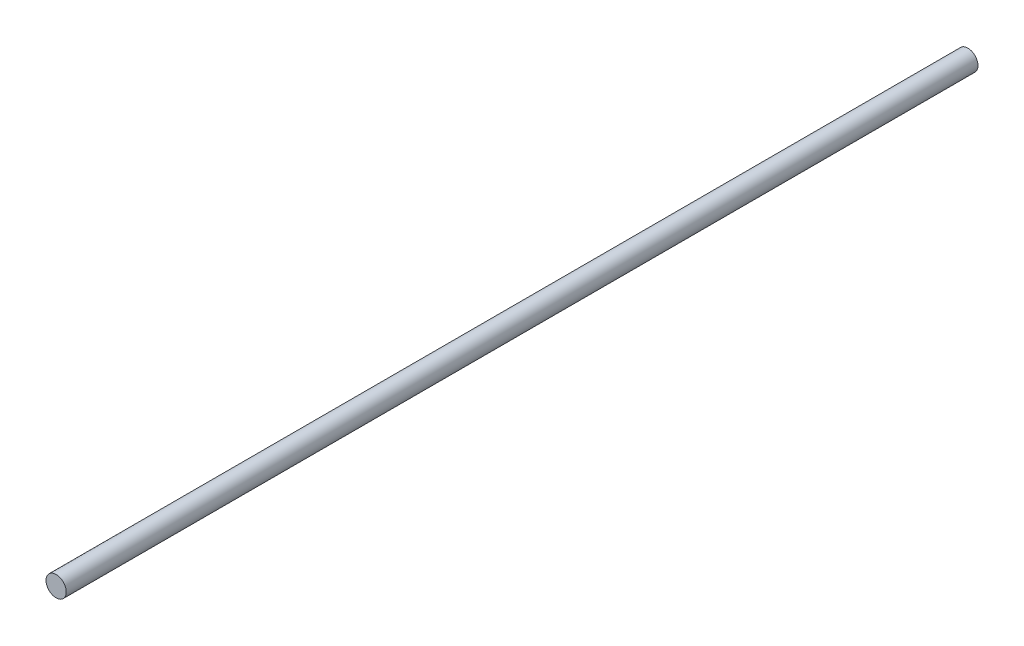
ISO-10303-21;
HEADER;
FILE_DESCRIPTION(('STEP AP214'),'2;1');
FILE_NAME('part.step','',(''),(''),'','','');
FILE_SCHEMA(('AUTOMOTIVE_DESIGN { 1 0 10303 214 1 1 1 1 }'));
ENDSEC;
DATA;
#1=APPLICATION_CONTEXT('core data for automotive mechanical design processes');
#2=APPLICATION_PROTOCOL_DEFINITION('international standard','automotive_design',2000,#1);
#3=PRODUCT_CONTEXT('',#1,'mechanical');
#4=PRODUCT('Part','Part','',(#3));
#5=PRODUCT_RELATED_PRODUCT_CATEGORY('part','',(#4));
#6=PRODUCT_DEFINITION_FORMATION('','',#4);
#7=PRODUCT_DEFINITION_CONTEXT('part definition',#1,'design');
#8=PRODUCT_DEFINITION('design','',#6,#7);
#9=PRODUCT_DEFINITION_SHAPE('','',#8);
#10=(LENGTH_UNIT() NAMED_UNIT(*) SI_UNIT(.MILLI.,.METRE.));
#11=(NAMED_UNIT(*) PLANE_ANGLE_UNIT() SI_UNIT($,.RADIAN.));
#12=(NAMED_UNIT(*) SI_UNIT($,.STERADIAN.) SOLID_ANGLE_UNIT());
#13=UNCERTAINTY_MEASURE_WITH_UNIT(LENGTH_MEASURE(1.E-05),#10,'distance_accuracy_value','');
#14=(GEOMETRIC_REPRESENTATION_CONTEXT(3) GLOBAL_UNCERTAINTY_ASSIGNED_CONTEXT((#13)) GLOBAL_UNIT_ASSIGNED_CONTEXT((#10,
#11,#12)) REPRESENTATION_CONTEXT('',''));
#15=CARTESIAN_POINT('',(0.,0.,0.));
#16=DIRECTION('',(0.,0.,1.));
#17=DIRECTION('',(1.,0.,0.));
#18=AXIS2_PLACEMENT_3D('',#15,#16,#17);
#19=CARTESIAN_POINT('',(0.,0.,360.));
#20=DIRECTION('',(0.,0.,-1.));
#21=DIRECTION('',(-1.,0.,0.));
#22=AXIS2_PLACEMENT_3D('',#19,#20,#21);
#23=CYLINDRICAL_SURFACE('',#22,4.);
#24=CARTESIAN_POINT('',(0.,0.,360.));
#25=DIRECTION('',(0.,0.,1.));
#26=DIRECTION('',(1.,0.,0.));
#27=AXIS2_PLACEMENT_3D('',#24,#25,#26);
#28=CIRCLE('',#27,4.);
#29=CARTESIAN_POINT('',(4.,0.,360.));
#30=VERTEX_POINT('',#29);
#31=EDGE_CURVE('E10',#30,#30,#28,.T.);
#32=ORIENTED_EDGE('',*,*,#31,.F.);
#33=EDGE_LOOP('',(#32));
#34=FACE_BOUND('',#33,.T.);
#35=CARTESIAN_POINT('',(0.,0.,0.));
#36=DIRECTION('',(0.,0.,1.));
#37=DIRECTION('',(1.,0.,0.));
#38=AXIS2_PLACEMENT_3D('',#35,#36,#37);
#39=CIRCLE('',#38,4.);
#40=CARTESIAN_POINT('',(4.,0.,0.));
#41=VERTEX_POINT('',#40);
#42=EDGE_CURVE('E31',#41,#41,#39,.T.);
#43=ORIENTED_EDGE('',*,*,#42,.T.);
#44=EDGE_LOOP('',(#43));
#45=FACE_BOUND('',#44,.T.);
#46=ADVANCED_FACE('F28',(#34,#45),#23,.T.);
#47=CARTESIAN_POINT('',(0.,0.,360.));
#48=DIRECTION('',(0.,0.,1.));
#49=DIRECTION('',(1.,0.,0.));
#50=AXIS2_PLACEMENT_3D('',#47,#48,#49);
#51=PLANE('',#50);
#52=ORIENTED_EDGE('',*,*,#31,.T.);
#53=EDGE_LOOP('',(#52));
#54=FACE_BOUND('',#53,.T.);
#55=ADVANCED_FACE('F43',(#54),#51,.T.);
#56=CARTESIAN_POINT('',(0.,0.,0.));
#57=DIRECTION('',(0.,0.,1.));
#58=DIRECTION('',(1.,0.,0.));
#59=AXIS2_PLACEMENT_3D('',#56,#57,#58);
#60=PLANE('',#59);
#61=ORIENTED_EDGE('',*,*,#42,.F.);
#62=EDGE_LOOP('',(#61));
#63=FACE_BOUND('',#62,.T.);
#64=ADVANCED_FACE('F41',(#63),#60,.F.);
#65=CLOSED_SHELL('',(#46,#55,#64));
#66=MANIFOLD_SOLID_BREP('B2',#65);
#67=ADVANCED_BREP_SHAPE_REPRESENTATION('',(#18,#66),#14);
#68=SHAPE_DEFINITION_REPRESENTATION(#9,#67);
ENDSEC;
END-ISO-10303-21;
